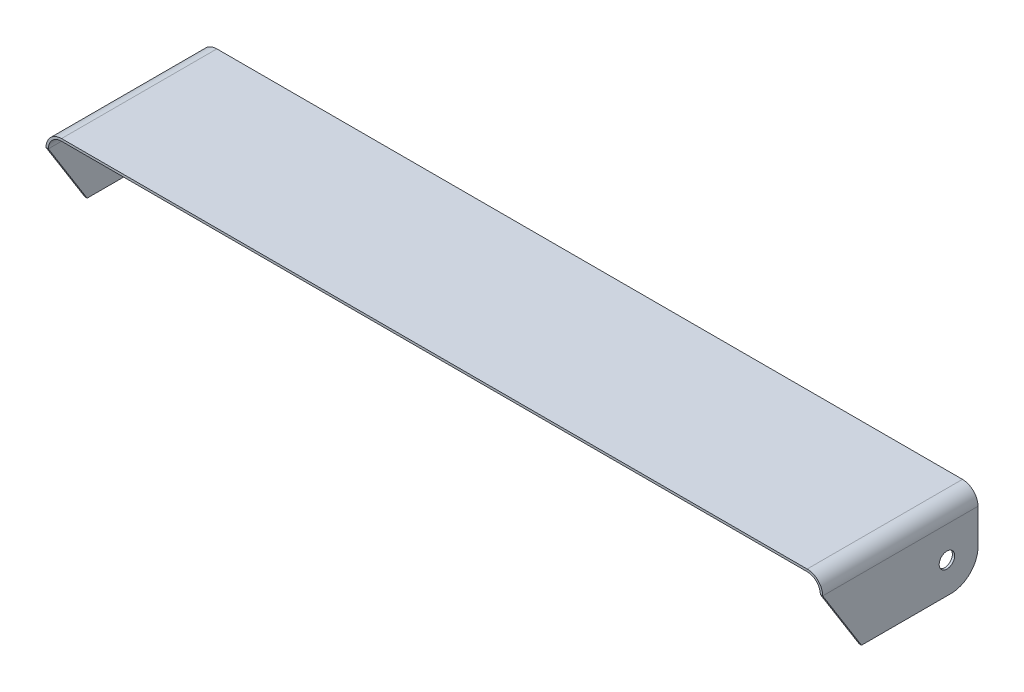
ISO-10303-21;
HEADER;
FILE_DESCRIPTION(('STEP AP214'),'2;1');
FILE_NAME('part.step','',(''),(''),'','','');
FILE_SCHEMA(('AUTOMOTIVE_DESIGN { 1 0 10303 214 1 1 1 1 }'));
ENDSEC;
DATA;
#1=APPLICATION_CONTEXT('core data for automotive mechanical design processes');
#2=APPLICATION_PROTOCOL_DEFINITION('international standard','automotive_design',2000,#1);
#3=PRODUCT_CONTEXT('',#1,'mechanical');
#4=PRODUCT('Part','Part','',(#3));
#5=PRODUCT_RELATED_PRODUCT_CATEGORY('part','',(#4));
#6=PRODUCT_DEFINITION_FORMATION('','',#4);
#7=PRODUCT_DEFINITION_CONTEXT('part definition',#1,'design');
#8=PRODUCT_DEFINITION('design','',#6,#7);
#9=PRODUCT_DEFINITION_SHAPE('','',#8);
#10=(LENGTH_UNIT() NAMED_UNIT(*) SI_UNIT(.MILLI.,.METRE.));
#11=(NAMED_UNIT(*) PLANE_ANGLE_UNIT() SI_UNIT($,.RADIAN.));
#12=(NAMED_UNIT(*) SI_UNIT($,.STERADIAN.) SOLID_ANGLE_UNIT());
#13=UNCERTAINTY_MEASURE_WITH_UNIT(LENGTH_MEASURE(1.E-05),#10,'distance_accuracy_value','');
#14=(GEOMETRIC_REPRESENTATION_CONTEXT(3) GLOBAL_UNCERTAINTY_ASSIGNED_CONTEXT((#13)) GLOBAL_UNIT_ASSIGNED_CONTEXT((#10,
#11,#12)) REPRESENTATION_CONTEXT('',''));
#15=CARTESIAN_POINT('',(0.,0.,0.));
#16=DIRECTION('',(0.,0.,1.));
#17=DIRECTION('',(1.,0.,0.));
#18=AXIS2_PLACEMENT_3D('',#15,#16,#17);
#19=CARTESIAN_POINT('',(-500.,0.,100.));
#20=DIRECTION('',(0.,1.,0.));
#21=DIRECTION('',(0.,0.,1.));
#22=AXIS2_PLACEMENT_3D('',#19,#20,#21);
#23=PLANE('',#22);
#24=DIRECTION('',(0.,0.,-1.));
#25=VECTOR('',#24,1.);
#26=CARTESIAN_POINT('',(-500.,0.,100.));
#27=LINE('',#26,#25);
#28=CARTESIAN_POINT('',(-500.,0.,50.));
#29=VERTEX_POINT('',#28);
#30=CARTESIAN_POINT('',(-500.,0.,-65.));
#31=VERTEX_POINT('',#30);
#32=EDGE_CURVE('E154',#29,#31,#27,.T.);
#33=ORIENTED_EDGE('',*,*,#32,.T.);
#34=DIRECTION('',(1.,0.,0.));
#35=VECTOR('',#34,1.);
#36=CARTESIAN_POINT('',(-497.,0.,-65.));
#37=LINE('',#36,#35);
#38=CARTESIAN_POINT('',(-497.,0.,-65.));
#39=VERTEX_POINT('',#38);
#40=EDGE_CURVE('E204',#31,#39,#37,.T.);
#41=ORIENTED_EDGE('',*,*,#40,.T.);
#42=DIRECTION('',(0.,0.,-1.));
#43=VECTOR('',#42,1.);
#44=CARTESIAN_POINT('',(-497.,0.,100.));
#45=LINE('',#44,#43);
#46=CARTESIAN_POINT('',(-497.,0.,50.));
#47=VERTEX_POINT('',#46);
#48=EDGE_CURVE('E198',#47,#39,#45,.T.);
#49=ORIENTED_EDGE('',*,*,#48,.F.);
#50=DIRECTION('',(1.,0.,0.));
#51=VECTOR('',#50,1.);
#52=CARTESIAN_POINT('',(-500.,0.,50.));
#53=LINE('',#52,#51);
#54=EDGE_CURVE('E241',#29,#47,#53,.T.);
#55=ORIENTED_EDGE('',*,*,#54,.F.);
#56=EDGE_LOOP('',(#33,#41,#49,#55));
#57=FACE_BOUND('',#56,.T.);
#58=ADVANCED_FACE('F33',(#57),#23,.F.);
#59=CARTESIAN_POINT('',(-497.,0.,100.));
#60=DIRECTION('',(-1.,0.,0.));
#61=DIRECTION('',(0.,0.,1.));
#62=AXIS2_PLACEMENT_3D('',#59,#60,#61);
#63=PLANE('',#62);
#64=CARTESIAN_POINT('',(-497.,40.,-60.));
#65=DIRECTION('',(-1.,0.,0.));
#66=DIRECTION('',(0.,0.,1.));
#67=AXIS2_PLACEMENT_3D('',#64,#65,#66);
#68=CIRCLE('',#67,10.);
#69=CARTESIAN_POINT('',(-497.,40.,-50.));
#70=VERTEX_POINT('',#69);
#71=EDGE_CURVE('E315',#70,#70,#68,.T.);
#72=ORIENTED_EDGE('',*,*,#71,.T.);
#73=EDGE_LOOP('',(#72));
#74=FACE_BOUND('',#73,.T.);
#75=ORIENTED_EDGE('',*,*,#48,.T.);
#76=CARTESIAN_POINT('',(-497.,35.,-65.));
#77=DIRECTION('',(-1.,0.,0.));
#78=DIRECTION('',(0.,0.,1.));
#79=AXIS2_PLACEMENT_3D('',#76,#77,#78);
#80=CIRCLE('',#79,35.);
#81=CARTESIAN_POINT('',(-497.,35.,-100.));
#82=VERTEX_POINT('',#81);
#83=EDGE_CURVE('E207',#39,#82,#80,.F.);
#84=ORIENTED_EDGE('',*,*,#83,.T.);
#85=DIRECTION('',(0.,1.,0.));
#86=VECTOR('',#85,1.);
#87=CARTESIAN_POINT('',(-497.,0.,-100.));
#88=LINE('',#87,#86);
#89=CARTESIAN_POINT('',(-497.,79.9999999999999,-100.));
#90=VERTEX_POINT('',#89);
#91=EDGE_CURVE('E276',#82,#90,#88,.T.);
#92=ORIENTED_EDGE('',*,*,#91,.T.);
#93=DIRECTION('',(0.,0.,-1.));
#94=VECTOR('',#93,1.);
#95=CARTESIAN_POINT('',(-497.,79.9999999999999,100.));
#96=LINE('',#95,#94);
#97=CARTESIAN_POINT('',(-497.,79.9999999999999,100.));
#98=VERTEX_POINT('',#97);
#99=EDGE_CURVE('E195',#98,#90,#96,.T.);
#100=ORIENTED_EDGE('',*,*,#99,.F.);
#101=DIRECTION('',(0.,-0.847998304005088,-0.52999894000318));
#102=VECTOR('',#101,1.);
#103=CARTESIAN_POINT('',(-497.,22.4719101123596,64.0449438202247));
#104=LINE('',#103,#102);
#105=EDGE_CURVE('E139',#98,#47,#104,.T.);
#106=ORIENTED_EDGE('',*,*,#105,.T.);
#107=EDGE_LOOP('',(#75,#84,#92,#100,#106));
#108=FACE_BOUND('',#107,.T.);
#109=ADVANCED_FACE('F289',(#74,#108),#63,.F.);
#110=CARTESIAN_POINT('',(-480.,80.,100.));
#111=DIRECTION('',(0.,0.,-1.));
#112=DIRECTION('',(-1.,0.,0.));
#113=AXIS2_PLACEMENT_3D('',#110,#111,#112);
#114=CYLINDRICAL_SURFACE('',#113,17.);
#115=CARTESIAN_POINT('',(-480.,80.,-100.));
#116=DIRECTION('',(0.,0.,-1.));
#117=DIRECTION('',(-1.,0.,0.));
#118=AXIS2_PLACEMENT_3D('',#115,#116,#117);
#119=CIRCLE('',#118,17.);
#120=CARTESIAN_POINT('',(-480.,97.,-100.));
#121=VERTEX_POINT('',#120);
#122=EDGE_CURVE('E258',#90,#121,#119,.T.);
#123=ORIENTED_EDGE('',*,*,#122,.T.);
#124=DIRECTION('',(0.,0.,-1.));
#125=VECTOR('',#124,1.);
#126=CARTESIAN_POINT('',(-480.,97.,100.));
#127=LINE('',#126,#125);
#128=CARTESIAN_POINT('',(-480.,97.,100.));
#129=VERTEX_POINT('',#128);
#130=EDGE_CURVE('E192',#129,#121,#127,.T.);
#131=ORIENTED_EDGE('',*,*,#130,.F.);
#132=CARTESIAN_POINT('',(-480.,80.,100.));
#133=DIRECTION('',(0.,0.,-1.));
#134=DIRECTION('',(-1.,0.,0.));
#135=AXIS2_PLACEMENT_3D('',#132,#133,#134);
#136=CIRCLE('',#135,17.);
#137=EDGE_CURVE('E266',#98,#129,#136,.T.);
#138=ORIENTED_EDGE('',*,*,#137,.F.);
#139=ORIENTED_EDGE('',*,*,#99,.T.);
#140=EDGE_LOOP('',(#123,#131,#138,#139));
#141=FACE_BOUND('',#140,.T.);
#142=ADVANCED_FACE('F279',(#141),#114,.F.);
#143=CARTESIAN_POINT('',(-480.,97.,100.));
#144=DIRECTION('',(0.,1.,0.));
#145=DIRECTION('',(-1.,0.,0.));
#146=AXIS2_PLACEMENT_3D('',#143,#144,#145);
#147=PLANE('',#146);
#148=DIRECTION('',(1.,0.,0.));
#149=VECTOR('',#148,1.);
#150=CARTESIAN_POINT('',(-480.,97.,-100.));
#151=LINE('',#150,#149);
#152=CARTESIAN_POINT('',(480.,97.,-100.));
#153=VERTEX_POINT('',#152);
#154=EDGE_CURVE('E255',#121,#153,#151,.T.);
#155=ORIENTED_EDGE('',*,*,#154,.T.);
#156=DIRECTION('',(0.,0.,-1.));
#157=VECTOR('',#156,1.);
#158=CARTESIAN_POINT('',(480.,97.,100.));
#159=LINE('',#158,#157);
#160=CARTESIAN_POINT('',(480.,97.,100.));
#161=VERTEX_POINT('',#160);
#162=EDGE_CURVE('E189',#161,#153,#159,.T.);
#163=ORIENTED_EDGE('',*,*,#162,.F.);
#164=DIRECTION('',(1.,0.,0.));
#165=VECTOR('',#164,1.);
#166=CARTESIAN_POINT('',(-480.,97.,100.));
#167=LINE('',#166,#165);
#168=EDGE_CURVE('E246',#129,#161,#167,.T.);
#169=ORIENTED_EDGE('',*,*,#168,.F.);
#170=ORIENTED_EDGE('',*,*,#130,.T.);
#171=EDGE_LOOP('',(#155,#163,#169,#170));
#172=FACE_BOUND('',#171,.T.);
#173=ADVANCED_FACE('F281',(#172),#147,.F.);
#174=CARTESIAN_POINT('',(480.,80.,100.));
#175=DIRECTION('',(0.,0.,-1.));
#176=DIRECTION('',(-1.,0.,0.));
#177=AXIS2_PLACEMENT_3D('',#174,#175,#176);
#178=CYLINDRICAL_SURFACE('',#177,17.);
#179=CARTESIAN_POINT('',(480.,80.,-100.));
#180=DIRECTION('',(0.,0.,-1.));
#181=DIRECTION('',(-1.,0.,0.));
#182=AXIS2_PLACEMENT_3D('',#179,#180,#181);
#183=CIRCLE('',#182,17.);
#184=CARTESIAN_POINT('',(497.,79.9999999999999,-100.));
#185=VERTEX_POINT('',#184);
#186=EDGE_CURVE('E253',#153,#185,#183,.T.);
#187=ORIENTED_EDGE('',*,*,#186,.T.);
#188=DIRECTION('',(0.,0.,-1.));
#189=VECTOR('',#188,1.);
#190=CARTESIAN_POINT('',(497.,79.9999999999999,100.));
#191=LINE('',#190,#189);
#192=CARTESIAN_POINT('',(497.,80.,100.));
#193=VERTEX_POINT('',#192);
#194=EDGE_CURVE('E186',#193,#185,#191,.T.);
#195=ORIENTED_EDGE('',*,*,#194,.F.);
#196=CARTESIAN_POINT('',(480.,80.,100.));
#197=DIRECTION('',(0.,0.,-1.));
#198=DIRECTION('',(-1.,0.,0.));
#199=AXIS2_PLACEMENT_3D('',#196,#197,#198);
#200=CIRCLE('',#199,17.);
#201=EDGE_CURVE('E244',#161,#193,#200,.T.);
#202=ORIENTED_EDGE('',*,*,#201,.F.);
#203=ORIENTED_EDGE('',*,*,#162,.T.);
#204=EDGE_LOOP('',(#187,#195,#202,#203));
#205=FACE_BOUND('',#204,.T.);
#206=ADVANCED_FACE('F251',(#205),#178,.F.);
#207=CARTESIAN_POINT('',(497.,79.9999999999999,100.));
#208=DIRECTION('',(1.,0.,0.));
#209=DIRECTION('',(0.,0.,-1.));
#210=AXIS2_PLACEMENT_3D('',#207,#208,#209);
#211=PLANE('',#210);
#212=CARTESIAN_POINT('',(497.,40.,-60.));
#213=DIRECTION('',(1.,0.,0.));
#214=DIRECTION('',(0.,0.,-1.));
#215=AXIS2_PLACEMENT_3D('',#212,#213,#214);
#216=CIRCLE('',#215,10.);
#217=CARTESIAN_POINT('',(497.,40.,-70.));
#218=VERTEX_POINT('',#217);
#219=EDGE_CURVE('E319',#218,#218,#216,.T.);
#220=ORIENTED_EDGE('',*,*,#219,.T.);
#221=EDGE_LOOP('',(#220));
#222=FACE_BOUND('',#221,.T.);
#223=DIRECTION('',(0.,-1.,0.));
#224=VECTOR('',#223,1.);
#225=CARTESIAN_POINT('',(497.,79.9999999999999,-100.));
#226=LINE('',#225,#224);
#227=CARTESIAN_POINT('',(497.,35.,-100.));
#228=VERTEX_POINT('',#227);
#229=EDGE_CURVE('E230',#185,#228,#226,.T.);
#230=ORIENTED_EDGE('',*,*,#229,.T.);
#231=CARTESIAN_POINT('',(497.,35.,-65.));
#232=DIRECTION('',(1.,0.,0.));
#233=DIRECTION('',(0.,0.,-1.));
#234=AXIS2_PLACEMENT_3D('',#231,#232,#233);
#235=CIRCLE('',#234,35.);
#236=CARTESIAN_POINT('',(497.,0.,-65.));
#237=VERTEX_POINT('',#236);
#238=EDGE_CURVE('E11',#228,#237,#235,.F.);
#239=ORIENTED_EDGE('',*,*,#238,.T.);
#240=DIRECTION('',(0.,0.,-1.));
#241=VECTOR('',#240,1.);
#242=CARTESIAN_POINT('',(497.,0.,100.));
#243=LINE('',#242,#241);
#244=CARTESIAN_POINT('',(497.,0.,50.));
#245=VERTEX_POINT('',#244);
#246=EDGE_CURVE('E184',#245,#237,#243,.T.);
#247=ORIENTED_EDGE('',*,*,#246,.F.);
#248=DIRECTION('',(0.,0.847998304005088,0.52999894000318));
#249=VECTOR('',#248,1.);
#250=CARTESIAN_POINT('',(497.,79.9999999999999,100.));
#251=LINE('',#250,#249);
#252=EDGE_CURVE('E237',#245,#193,#251,.T.);
#253=ORIENTED_EDGE('',*,*,#252,.T.);
#254=ORIENTED_EDGE('',*,*,#194,.T.);
#255=EDGE_LOOP('',(#230,#239,#247,#253,#254));
#256=FACE_BOUND('',#255,.T.);
#257=ADVANCED_FACE('F236',(#222,#256),#211,.F.);
#258=CARTESIAN_POINT('',(497.,0.,100.));
#259=DIRECTION('',(0.,1.,0.));
#260=DIRECTION('',(0.,0.,1.));
#261=AXIS2_PLACEMENT_3D('',#258,#259,#260);
#262=PLANE('',#261);
#263=ORIENTED_EDGE('',*,*,#246,.T.);
#264=DIRECTION('',(1.,0.,0.));
#265=VECTOR('',#264,1.);
#266=CARTESIAN_POINT('',(500.,0.,-65.));
#267=LINE('',#266,#265);
#268=CARTESIAN_POINT('',(500.,0.,-65.));
#269=VERTEX_POINT('',#268);
#270=EDGE_CURVE('E215',#237,#269,#267,.T.);
#271=ORIENTED_EDGE('',*,*,#270,.T.);
#272=DIRECTION('',(0.,0.,-1.));
#273=VECTOR('',#272,1.);
#274=CARTESIAN_POINT('',(500.,0.,100.));
#275=LINE('',#274,#273);
#276=CARTESIAN_POINT('',(500.,0.,50.));
#277=VERTEX_POINT('',#276);
#278=EDGE_CURVE('E181',#277,#269,#275,.T.);
#279=ORIENTED_EDGE('',*,*,#278,.F.);
#280=EDGE_CURVE('E143',#245,#277,#53,.T.);
#281=ORIENTED_EDGE('',*,*,#280,.F.);
#282=EDGE_LOOP('',(#263,#271,#279,#281));
#283=FACE_BOUND('',#282,.T.);
#284=ADVANCED_FACE('F233',(#283),#262,.F.);
#285=CARTESIAN_POINT('',(500.,79.9999999999999,100.));
#286=DIRECTION('',(-1.,0.,0.));
#287=DIRECTION('',(0.,0.,1.));
#288=AXIS2_PLACEMENT_3D('',#285,#286,#287);
#289=PLANE('',#288);
#290=CARTESIAN_POINT('',(500.,40.,-60.));
#291=DIRECTION('',(1.,0.,0.));
#292=DIRECTION('',(0.,0.,-1.));
#293=AXIS2_PLACEMENT_3D('',#290,#291,#292);
#294=CIRCLE('',#293,10.);
#295=CARTESIAN_POINT('',(500.,40.,-70.));
#296=VERTEX_POINT('',#295);
#297=EDGE_CURVE('E323',#296,#296,#294,.T.);
#298=ORIENTED_EDGE('',*,*,#297,.F.);
#299=EDGE_LOOP('',(#298));
#300=FACE_BOUND('',#299,.T.);
#301=ORIENTED_EDGE('',*,*,#278,.T.);
#302=CARTESIAN_POINT('',(500.,35.,-65.));
#303=DIRECTION('',(-1.,0.,0.));
#304=DIRECTION('',(0.,0.,1.));
#305=AXIS2_PLACEMENT_3D('',#302,#303,#304);
#306=CIRCLE('',#305,35.);
#307=CARTESIAN_POINT('',(500.,35.,-100.));
#308=VERTEX_POINT('',#307);
#309=EDGE_CURVE('E41',#269,#308,#306,.F.);
#310=ORIENTED_EDGE('',*,*,#309,.T.);
#311=DIRECTION('',(0.,1.,0.));
#312=VECTOR('',#311,1.);
#313=CARTESIAN_POINT('',(500.,79.9999999999999,-100.));
#314=LINE('',#313,#312);
#315=CARTESIAN_POINT('',(500.,79.9999999999999,-100.));
#316=VERTEX_POINT('',#315);
#317=EDGE_CURVE('E220',#308,#316,#314,.T.);
#318=ORIENTED_EDGE('',*,*,#317,.T.);
#319=DIRECTION('',(0.,0.,-1.));
#320=VECTOR('',#319,1.);
#321=CARTESIAN_POINT('',(500.,79.9999999999999,100.));
#322=LINE('',#321,#320);
#323=CARTESIAN_POINT('',(500.,79.9999999999999,100.));
#324=VERTEX_POINT('',#323);
#325=EDGE_CURVE('E178',#324,#316,#322,.T.);
#326=ORIENTED_EDGE('',*,*,#325,.F.);
#327=DIRECTION('',(0.,0.847998304005088,0.52999894000318));
#328=VECTOR('',#327,1.);
#329=CARTESIAN_POINT('',(500.,0.,50.));
#330=LINE('',#329,#328);
#331=EDGE_CURVE('E155',#277,#324,#330,.T.);
#332=ORIENTED_EDGE('',*,*,#331,.F.);
#333=EDGE_LOOP('',(#301,#310,#318,#326,#332));
#334=FACE_BOUND('',#333,.T.);
#335=ADVANCED_FACE('F218',(#300,#334),#289,.F.);
#336=CARTESIAN_POINT('',(480.,80.,100.));
#337=DIRECTION('',(0.,0.,-1.));
#338=DIRECTION('',(-1.,0.,0.));
#339=AXIS2_PLACEMENT_3D('',#336,#337,#338);
#340=CYLINDRICAL_SURFACE('',#339,20.);
#341=CARTESIAN_POINT('',(480.,80.,-100.));
#342=DIRECTION('',(0.,0.,1.));
#343=DIRECTION('',(-1.,0.,0.));
#344=AXIS2_PLACEMENT_3D('',#341,#342,#343);
#345=CIRCLE('',#344,20.);
#346=CARTESIAN_POINT('',(480.,100.,-100.));
#347=VERTEX_POINT('',#346);
#348=EDGE_CURVE('E229',#316,#347,#345,.T.);
#349=ORIENTED_EDGE('',*,*,#348,.T.);
#350=DIRECTION('',(0.,0.,-1.));
#351=VECTOR('',#350,1.);
#352=CARTESIAN_POINT('',(480.,100.,100.));
#353=LINE('',#352,#351);
#354=CARTESIAN_POINT('',(480.,100.,100.));
#355=VERTEX_POINT('',#354);
#356=EDGE_CURVE('E171',#355,#347,#353,.T.);
#357=ORIENTED_EDGE('',*,*,#356,.F.);
#358=CARTESIAN_POINT('',(480.,80.,100.));
#359=DIRECTION('',(0.,0.,1.));
#360=DIRECTION('',(-1.,0.,0.));
#361=AXIS2_PLACEMENT_3D('',#358,#359,#360);
#362=CIRCLE('',#361,20.);
#363=EDGE_CURVE('E249',#324,#355,#362,.T.);
#364=ORIENTED_EDGE('',*,*,#363,.F.);
#365=ORIENTED_EDGE('',*,*,#325,.T.);
#366=EDGE_LOOP('',(#349,#357,#364,#365));
#367=FACE_BOUND('',#366,.T.);
#368=ADVANCED_FACE('F339',(#367),#340,.T.);
#369=CARTESIAN_POINT('',(-480.,100.,100.));
#370=DIRECTION('',(0.,-1.,0.));
#371=DIRECTION('',(0.,0.,-1.));
#372=AXIS2_PLACEMENT_3D('',#369,#370,#371);
#373=PLANE('',#372);
#374=DIRECTION('',(-1.,0.,0.));
#375=VECTOR('',#374,1.);
#376=CARTESIAN_POINT('',(-480.,100.,-100.));
#377=LINE('',#376,#375);
#378=CARTESIAN_POINT('',(-480.,100.,-100.));
#379=VERTEX_POINT('',#378);
#380=EDGE_CURVE('E263',#347,#379,#377,.T.);
#381=ORIENTED_EDGE('',*,*,#380,.T.);
#382=DIRECTION('',(0.,0.,-1.));
#383=VECTOR('',#382,1.);
#384=CARTESIAN_POINT('',(-480.,100.,100.));
#385=LINE('',#384,#383);
#386=CARTESIAN_POINT('',(-480.,100.,100.));
#387=VERTEX_POINT('',#386);
#388=EDGE_CURVE('E169',#387,#379,#385,.T.);
#389=ORIENTED_EDGE('',*,*,#388,.F.);
#390=DIRECTION('',(-1.,0.,0.));
#391=VECTOR('',#390,1.);
#392=CARTESIAN_POINT('',(-480.,100.,100.));
#393=LINE('',#392,#391);
#394=EDGE_CURVE('E161',#355,#387,#393,.T.);
#395=ORIENTED_EDGE('',*,*,#394,.F.);
#396=ORIENTED_EDGE('',*,*,#356,.T.);
#397=EDGE_LOOP('',(#381,#389,#395,#396));
#398=FACE_BOUND('',#397,.T.);
#399=ADVANCED_FACE('F335',(#398),#373,.F.);
#400=CARTESIAN_POINT('',(-480.,80.,100.));
#401=DIRECTION('',(0.,0.,-1.));
#402=DIRECTION('',(-1.,0.,0.));
#403=AXIS2_PLACEMENT_3D('',#400,#401,#402);
#404=CYLINDRICAL_SURFACE('',#403,20.);
#405=CARTESIAN_POINT('',(-480.,80.,-100.));
#406=DIRECTION('',(0.,0.,1.));
#407=DIRECTION('',(-1.,0.,0.));
#408=AXIS2_PLACEMENT_3D('',#405,#406,#407);
#409=CIRCLE('',#408,20.);
#410=CARTESIAN_POINT('',(-500.,79.9999999999999,-100.));
#411=VERTEX_POINT('',#410);
#412=EDGE_CURVE('E168',#379,#411,#409,.T.);
#413=ORIENTED_EDGE('',*,*,#412,.T.);
#414=DIRECTION('',(0.,0.,-1.));
#415=VECTOR('',#414,1.);
#416=CARTESIAN_POINT('',(-500.,79.9999999999999,100.));
#417=LINE('',#416,#415);
#418=CARTESIAN_POINT('',(-500.,80.,100.));
#419=VERTEX_POINT('',#418);
#420=EDGE_CURVE('E151',#419,#411,#417,.T.);
#421=ORIENTED_EDGE('',*,*,#420,.F.);
#422=CARTESIAN_POINT('',(-480.,80.,100.));
#423=DIRECTION('',(0.,0.,1.));
#424=DIRECTION('',(-1.,0.,0.));
#425=AXIS2_PLACEMENT_3D('',#422,#423,#424);
#426=CIRCLE('',#425,20.);
#427=EDGE_CURVE('E158',#387,#419,#426,.T.);
#428=ORIENTED_EDGE('',*,*,#427,.F.);
#429=ORIENTED_EDGE('',*,*,#388,.T.);
#430=EDGE_LOOP('',(#413,#421,#428,#429));
#431=FACE_BOUND('',#430,.T.);
#432=ADVANCED_FACE('F166',(#431),#404,.T.);
#433=CARTESIAN_POINT('',(-500.,0.,100.));
#434=DIRECTION('',(1.,0.,0.));
#435=DIRECTION('',(0.,0.,-1.));
#436=AXIS2_PLACEMENT_3D('',#433,#434,#435);
#437=PLANE('',#436);
#438=CARTESIAN_POINT('',(-500.,40.,-60.));
#439=DIRECTION('',(1.,0.,0.));
#440=DIRECTION('',(0.,0.,-1.));
#441=AXIS2_PLACEMENT_3D('',#438,#439,#440);
#442=CIRCLE('',#441,10.);
#443=CARTESIAN_POINT('',(-500.,40.,-70.));
#444=VERTEX_POINT('',#443);
#445=EDGE_CURVE('E322',#444,#444,#442,.T.);
#446=ORIENTED_EDGE('',*,*,#445,.T.);
#447=EDGE_LOOP('',(#446));
#448=FACE_BOUND('',#447,.T.);
#449=DIRECTION('',(0.,-1.,0.));
#450=VECTOR('',#449,1.);
#451=CARTESIAN_POINT('',(-500.,0.,-100.));
#452=LINE('',#451,#450);
#453=CARTESIAN_POINT('',(-500.,35.,-100.));
#454=VERTEX_POINT('',#453);
#455=EDGE_CURVE('E265',#411,#454,#452,.T.);
#456=ORIENTED_EDGE('',*,*,#455,.T.);
#457=CARTESIAN_POINT('',(-500.,35.,-65.));
#458=DIRECTION('',(1.,0.,0.));
#459=DIRECTION('',(0.,0.,-1.));
#460=AXIS2_PLACEMENT_3D('',#457,#458,#459);
#461=CIRCLE('',#460,35.);
#462=EDGE_CURVE('E213',#454,#31,#461,.F.);
#463=ORIENTED_EDGE('',*,*,#462,.T.);
#464=ORIENTED_EDGE('',*,*,#32,.F.);
#465=DIRECTION('',(0.,0.847998304005088,0.52999894000318));
#466=VECTOR('',#465,1.);
#467=CARTESIAN_POINT('',(-500.,0.,50.));
#468=LINE('',#467,#466);
#469=EDGE_CURVE('E136',#29,#419,#468,.T.);
#470=ORIENTED_EDGE('',*,*,#469,.T.);
#471=ORIENTED_EDGE('',*,*,#420,.T.);
#472=EDGE_LOOP('',(#456,#463,#464,#470,#471));
#473=FACE_BOUND('',#472,.T.);
#474=ADVANCED_FACE('F149',(#448,#473),#437,.F.);
#475=CARTESIAN_POINT('',(-480.,80.,100.));
#476=DIRECTION('',(0.,0.,-1.));
#477=DIRECTION('',(-1.,0.,0.));
#478=AXIS2_PLACEMENT_3D('',#475,#476,#477);
#479=PLANE('',#478);
#480=ORIENTED_EDGE('',*,*,#427,.T.);
#481=DIRECTION('',(1.,0.,0.));
#482=VECTOR('',#481,1.);
#483=CARTESIAN_POINT('',(-500.,80.,100.));
#484=LINE('',#483,#482);
#485=EDGE_CURVE('E133',#419,#98,#484,.T.);
#486=ORIENTED_EDGE('',*,*,#485,.T.);
#487=ORIENTED_EDGE('',*,*,#137,.T.);
#488=ORIENTED_EDGE('',*,*,#168,.T.);
#489=ORIENTED_EDGE('',*,*,#201,.T.);
#490=DIRECTION('',(1.,0.,0.));
#491=VECTOR('',#490,1.);
#492=CARTESIAN_POINT('',(-480.,80.,100.));
#493=LINE('',#492,#491);
#494=EDGE_CURVE('E201',#193,#324,#493,.T.);
#495=ORIENTED_EDGE('',*,*,#494,.T.);
#496=ORIENTED_EDGE('',*,*,#363,.T.);
#497=ORIENTED_EDGE('',*,*,#394,.T.);
#498=EDGE_LOOP('',(#480,#486,#487,#488,#489,#495,#496,#497));
#499=FACE_BOUND('',#498,.T.);
#500=ADVANCED_FACE('F159',(#499),#479,.F.);
#501=CARTESIAN_POINT('',(-480.,80.,-100.));
#502=DIRECTION('',(0.,0.,-1.));
#503=DIRECTION('',(-1.,0.,0.));
#504=AXIS2_PLACEMENT_3D('',#501,#502,#503);
#505=PLANE('',#504);
#506=ORIENTED_EDGE('',*,*,#91,.F.);
#507=DIRECTION('',(1.,0.,0.));
#508=VECTOR('',#507,1.);
#509=CARTESIAN_POINT('',(-500.,35.,-100.));
#510=LINE('',#509,#508);
#511=EDGE_CURVE('E211',#82,#454,#510,.F.);
#512=ORIENTED_EDGE('',*,*,#511,.T.);
#513=ORIENTED_EDGE('',*,*,#455,.F.);
#514=ORIENTED_EDGE('',*,*,#412,.F.);
#515=ORIENTED_EDGE('',*,*,#380,.F.);
#516=ORIENTED_EDGE('',*,*,#348,.F.);
#517=ORIENTED_EDGE('',*,*,#317,.F.);
#518=DIRECTION('',(1.,0.,0.));
#519=VECTOR('',#518,1.);
#520=CARTESIAN_POINT('',(497.,35.,-100.));
#521=LINE('',#520,#519);
#522=EDGE_CURVE('E209',#308,#228,#521,.F.);
#523=ORIENTED_EDGE('',*,*,#522,.T.);
#524=ORIENTED_EDGE('',*,*,#229,.F.);
#525=ORIENTED_EDGE('',*,*,#186,.F.);
#526=ORIENTED_EDGE('',*,*,#154,.F.);
#527=ORIENTED_EDGE('',*,*,#122,.F.);
#528=EDGE_LOOP('',(#506,#512,#513,#514,#515,#516,#517,#523,#524,#525,#526,#527));
#529=FACE_BOUND('',#528,.T.);
#530=ADVANCED_FACE('F226',(#529),#505,.T.);
#531=CARTESIAN_POINT('',(-500.,0.,50.));
#532=DIRECTION('',(0.,0.52999894000318,-0.847998304005088));
#533=DIRECTION('',(0.,0.847998304005088,0.52999894000318));
#534=AXIS2_PLACEMENT_3D('',#531,#532,#533);
#535=PLANE('',#534);
#536=ORIENTED_EDGE('',*,*,#280,.T.);
#537=ORIENTED_EDGE('',*,*,#331,.T.);
#538=ORIENTED_EDGE('',*,*,#494,.F.);
#539=ORIENTED_EDGE('',*,*,#252,.F.);
#540=EDGE_LOOP('',(#536,#537,#538,#539));
#541=FACE_BOUND('',#540,.T.);
#542=ADVANCED_FACE('F340',(#541),#535,.F.);
#543=ORIENTED_EDGE('',*,*,#485,.F.);
#544=ORIENTED_EDGE('',*,*,#469,.F.);
#545=ORIENTED_EDGE('',*,*,#54,.T.);
#546=ORIENTED_EDGE('',*,*,#105,.F.);
#547=EDGE_LOOP('',(#543,#544,#545,#546));
#548=FACE_BOUND('',#547,.T.);
#549=ADVANCED_FACE('F135',(#548),#535,.F.);
#550=CARTESIAN_POINT('',(-500.,40.,-60.));
#551=DIRECTION('',(1.,0.,0.));
#552=DIRECTION('',(0.,0.,-1.));
#553=AXIS2_PLACEMENT_3D('',#550,#551,#552);
#554=CYLINDRICAL_SURFACE('',#553,10.);
#555=ORIENTED_EDGE('',*,*,#445,.F.);
#556=EDGE_LOOP('',(#555));
#557=FACE_BOUND('',#556,.T.);
#558=ORIENTED_EDGE('',*,*,#71,.F.);
#559=EDGE_LOOP('',(#558));
#560=FACE_BOUND('',#559,.T.);
#561=ADVANCED_FACE('F307',(#557,#560),#554,.F.);
#562=ORIENTED_EDGE('',*,*,#297,.T.);
#563=EDGE_LOOP('',(#562));
#564=FACE_BOUND('',#563,.T.);
#565=ORIENTED_EDGE('',*,*,#219,.F.);
#566=EDGE_LOOP('',(#565));
#567=FACE_BOUND('',#566,.T.);
#568=ADVANCED_FACE('F301',(#564,#567),#554,.F.);
#569=CARTESIAN_POINT('',(-500.,35.,-65.));
#570=DIRECTION('',(-1.,0.,0.));
#571=DIRECTION('',(0.,0.,1.));
#572=AXIS2_PLACEMENT_3D('',#569,#570,#571);
#573=CYLINDRICAL_SURFACE('',#572,35.);
#574=ORIENTED_EDGE('',*,*,#462,.F.);
#575=ORIENTED_EDGE('',*,*,#511,.F.);
#576=ORIENTED_EDGE('',*,*,#83,.F.);
#577=ORIENTED_EDGE('',*,*,#40,.F.);
#578=EDGE_LOOP('',(#574,#575,#576,#577));
#579=FACE_BOUND('',#578,.T.);
#580=ADVANCED_FACE('F299',(#579),#573,.T.);
#581=CARTESIAN_POINT('',(497.,35.,-65.));
#582=DIRECTION('',(-1.,0.,0.));
#583=DIRECTION('',(0.,0.,1.));
#584=AXIS2_PLACEMENT_3D('',#581,#582,#583);
#585=CYLINDRICAL_SURFACE('',#584,35.);
#586=ORIENTED_EDGE('',*,*,#238,.F.);
#587=ORIENTED_EDGE('',*,*,#522,.F.);
#588=ORIENTED_EDGE('',*,*,#309,.F.);
#589=ORIENTED_EDGE('',*,*,#270,.F.);
#590=EDGE_LOOP('',(#586,#587,#588,#589));
#591=FACE_BOUND('',#590,.T.);
#592=ADVANCED_FACE('F35',(#591),#585,.T.);
#593=CLOSED_SHELL('',(#58,#109,#142,#173,#206,#257,#284,#335,#368,#399,#432,#474,#500,#530,#542,
#549,#561,#568,#580,#592));
#594=MANIFOLD_SOLID_BREP('B2',#593);
#595=ADVANCED_BREP_SHAPE_REPRESENTATION('',(#18,#594),#14);
#596=SHAPE_DEFINITION_REPRESENTATION(#9,#595);
ENDSEC;
END-ISO-10303-21;
